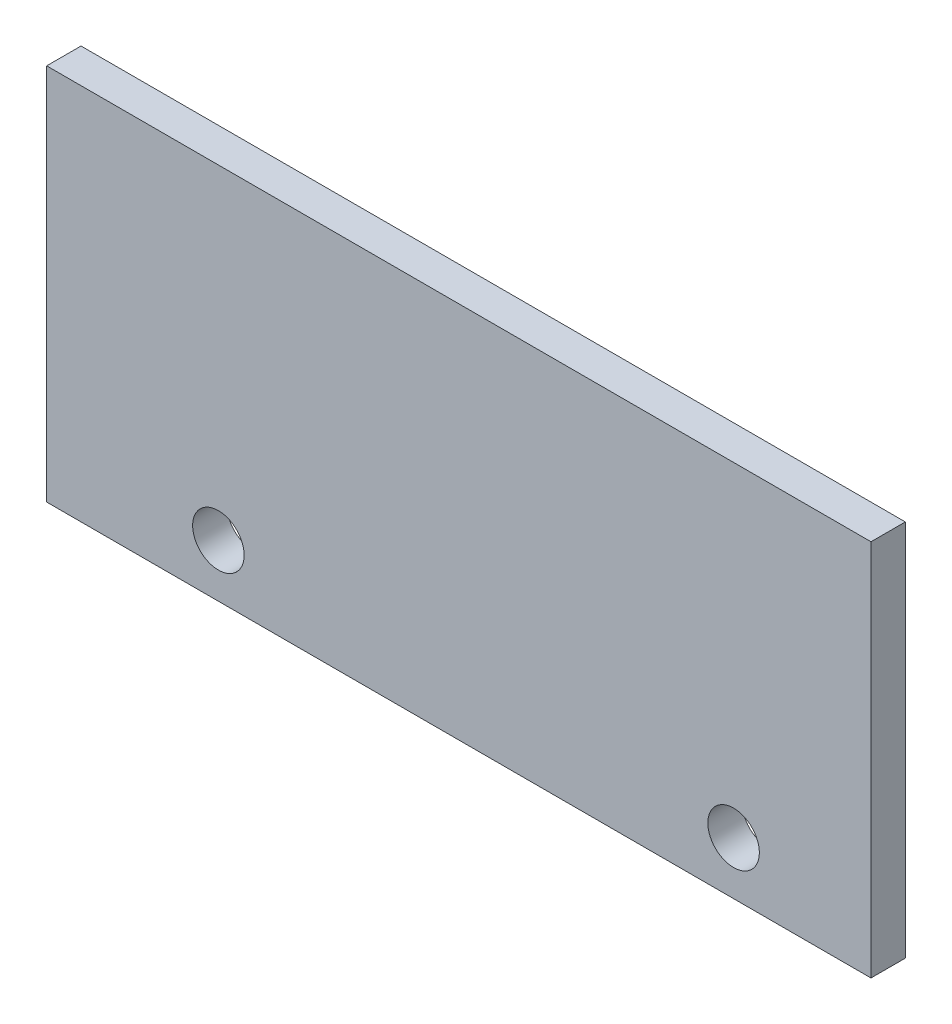
ISO-10303-21;
HEADER;
FILE_DESCRIPTION(('STEP AP214'),'2;1');
FILE_NAME('part.step','',(''),(''),'','','');
FILE_SCHEMA(('AUTOMOTIVE_DESIGN { 1 0 10303 214 1 1 1 1 }'));
ENDSEC;
DATA;
#1=APPLICATION_CONTEXT('core data for automotive mechanical design processes');
#2=APPLICATION_PROTOCOL_DEFINITION('international standard','automotive_design',2000,#1);
#3=PRODUCT_CONTEXT('',#1,'mechanical');
#4=PRODUCT('Part','Part','',(#3));
#5=PRODUCT_RELATED_PRODUCT_CATEGORY('part','',(#4));
#6=PRODUCT_DEFINITION_FORMATION('','',#4);
#7=PRODUCT_DEFINITION_CONTEXT('part definition',#1,'design');
#8=PRODUCT_DEFINITION('design','',#6,#7);
#9=PRODUCT_DEFINITION_SHAPE('','',#8);
#10=(LENGTH_UNIT() NAMED_UNIT(*) SI_UNIT(.MILLI.,.METRE.));
#11=(NAMED_UNIT(*) PLANE_ANGLE_UNIT() SI_UNIT($,.RADIAN.));
#12=(NAMED_UNIT(*) SI_UNIT($,.STERADIAN.) SOLID_ANGLE_UNIT());
#13=UNCERTAINTY_MEASURE_WITH_UNIT(LENGTH_MEASURE(1.E-05),#10,'distance_accuracy_value','');
#14=(GEOMETRIC_REPRESENTATION_CONTEXT(3) GLOBAL_UNCERTAINTY_ASSIGNED_CONTEXT((#13)) GLOBAL_UNIT_ASSIGNED_CONTEXT((#10,
#11,#12)) REPRESENTATION_CONTEXT('',''));
#15=CARTESIAN_POINT('',(0.,0.,0.));
#16=DIRECTION('',(0.,0.,1.));
#17=DIRECTION('',(1.,0.,0.));
#18=AXIS2_PLACEMENT_3D('',#15,#16,#17);
#19=CARTESIAN_POINT('',(673.1,330.2,6.35));
#20=DIRECTION('',(1.,0.,0.));
#21=DIRECTION('',(0.,1.,0.));
#22=AXIS2_PLACEMENT_3D('',#19,#20,#21);
#23=PLANE('',#22);
#24=DIRECTION('',(0.,-1.,0.));
#25=VECTOR('',#24,1.);
#26=CARTESIAN_POINT('',(673.1,330.2,0.));
#27=LINE('',#26,#25);
#28=CARTESIAN_POINT('',(673.1,330.2,0.));
#29=VERTEX_POINT('',#28);
#30=CARTESIAN_POINT('',(673.1,260.35,0.));
#31=VERTEX_POINT('',#30);
#32=EDGE_CURVE('E113',#29,#31,#27,.T.);
#33=ORIENTED_EDGE('',*,*,#32,.T.);
#34=DIRECTION('',(0.,0.,-1.));
#35=VECTOR('',#34,1.);
#36=CARTESIAN_POINT('',(673.1,260.35,6.35));
#37=LINE('',#36,#35);
#38=CARTESIAN_POINT('',(673.1,260.35,6.35));
#39=VERTEX_POINT('',#38);
#40=EDGE_CURVE('E11',#39,#31,#37,.T.);
#41=ORIENTED_EDGE('',*,*,#40,.F.);
#42=DIRECTION('',(0.,-1.,0.));
#43=VECTOR('',#42,1.);
#44=CARTESIAN_POINT('',(673.1,330.2,6.35));
#45=LINE('',#44,#43);
#46=CARTESIAN_POINT('',(673.1,330.2,6.35));
#47=VERTEX_POINT('',#46);
#48=EDGE_CURVE('E96',#47,#39,#45,.T.);
#49=ORIENTED_EDGE('',*,*,#48,.F.);
#50=DIRECTION('',(0.,0.,-1.));
#51=VECTOR('',#50,1.);
#52=CARTESIAN_POINT('',(673.1,330.2,6.35));
#53=LINE('',#52,#51);
#54=EDGE_CURVE('E109',#47,#29,#53,.T.);
#55=ORIENTED_EDGE('',*,*,#54,.T.);
#56=EDGE_LOOP('',(#33,#41,#49,#55));
#57=FACE_BOUND('',#56,.T.);
#58=ADVANCED_FACE('F38',(#57),#23,.F.);
#59=CARTESIAN_POINT('',(673.1,260.35,6.35));
#60=DIRECTION('',(0.,1.,0.));
#61=DIRECTION('',(0.,0.,1.));
#62=AXIS2_PLACEMENT_3D('',#59,#60,#61);
#63=PLANE('',#62);
#64=DIRECTION('',(1.,0.,0.));
#65=VECTOR('',#64,1.);
#66=CARTESIAN_POINT('',(673.1,260.35,0.));
#67=LINE('',#66,#65);
#68=CARTESIAN_POINT('',(825.5,260.35,0.));
#69=VERTEX_POINT('',#68);
#70=EDGE_CURVE('E101',#31,#69,#67,.T.);
#71=ORIENTED_EDGE('',*,*,#70,.T.);
#72=DIRECTION('',(0.,0.,-1.));
#73=VECTOR('',#72,1.);
#74=CARTESIAN_POINT('',(825.5,260.35,6.35));
#75=LINE('',#74,#73);
#76=CARTESIAN_POINT('',(825.5,260.35,6.35));
#77=VERTEX_POINT('',#76);
#78=EDGE_CURVE('E47',#77,#69,#75,.T.);
#79=ORIENTED_EDGE('',*,*,#78,.F.);
#80=DIRECTION('',(1.,0.,0.));
#81=VECTOR('',#80,1.);
#82=CARTESIAN_POINT('',(673.1,260.35,6.35));
#83=LINE('',#82,#81);
#84=EDGE_CURVE('E91',#39,#77,#83,.T.);
#85=ORIENTED_EDGE('',*,*,#84,.F.);
#86=ORIENTED_EDGE('',*,*,#40,.T.);
#87=EDGE_LOOP('',(#71,#79,#85,#86));
#88=FACE_BOUND('',#87,.T.);
#89=ADVANCED_FACE('F100',(#88),#63,.F.);
#90=CARTESIAN_POINT('',(825.5,330.2,6.35));
#91=DIRECTION('',(-1.,0.,0.));
#92=DIRECTION('',(0.,0.,1.));
#93=AXIS2_PLACEMENT_3D('',#90,#91,#92);
#94=PLANE('',#93);
#95=DIRECTION('',(0.,1.,0.));
#96=VECTOR('',#95,1.);
#97=CARTESIAN_POINT('',(825.5,330.2,0.));
#98=LINE('',#97,#96);
#99=CARTESIAN_POINT('',(825.5,330.2,0.));
#100=VERTEX_POINT('',#99);
#101=EDGE_CURVE('E77',#69,#100,#98,.T.);
#102=ORIENTED_EDGE('',*,*,#101,.T.);
#103=DIRECTION('',(0.,0.,-1.));
#104=VECTOR('',#103,1.);
#105=CARTESIAN_POINT('',(825.5,330.2,6.35));
#106=LINE('',#105,#104);
#107=CARTESIAN_POINT('',(825.5,330.2,6.35));
#108=VERTEX_POINT('',#107);
#109=EDGE_CURVE('E102',#108,#100,#106,.T.);
#110=ORIENTED_EDGE('',*,*,#109,.F.);
#111=DIRECTION('',(0.,1.,0.));
#112=VECTOR('',#111,1.);
#113=CARTESIAN_POINT('',(825.5,330.2,6.35));
#114=LINE('',#113,#112);
#115=EDGE_CURVE('E94',#77,#108,#114,.T.);
#116=ORIENTED_EDGE('',*,*,#115,.F.);
#117=ORIENTED_EDGE('',*,*,#78,.T.);
#118=EDGE_LOOP('',(#102,#110,#116,#117));
#119=FACE_BOUND('',#118,.T.);
#120=ADVANCED_FACE('F103',(#119),#94,.F.);
#121=CARTESIAN_POINT('',(673.1,330.2,6.35));
#122=DIRECTION('',(0.,-1.,0.));
#123=DIRECTION('',(1.,0.,0.));
#124=AXIS2_PLACEMENT_3D('',#121,#122,#123);
#125=PLANE('',#124);
#126=DIRECTION('',(-1.,0.,0.));
#127=VECTOR('',#126,1.);
#128=CARTESIAN_POINT('',(673.1,330.2,0.));
#129=LINE('',#128,#127);
#130=EDGE_CURVE('E84',#100,#29,#129,.T.);
#131=ORIENTED_EDGE('',*,*,#130,.T.);
#132=ORIENTED_EDGE('',*,*,#54,.F.);
#133=DIRECTION('',(-1.,0.,0.));
#134=VECTOR('',#133,1.);
#135=CARTESIAN_POINT('',(673.1,330.2,6.35));
#136=LINE('',#135,#134);
#137=EDGE_CURVE('E57',#108,#47,#136,.T.);
#138=ORIENTED_EDGE('',*,*,#137,.F.);
#139=ORIENTED_EDGE('',*,*,#109,.T.);
#140=EDGE_LOOP('',(#131,#132,#138,#139));
#141=FACE_BOUND('',#140,.T.);
#142=ADVANCED_FACE('F125',(#141),#125,.F.);
#143=CARTESIAN_POINT('',(673.1,260.35,6.35));
#144=DIRECTION('',(0.,0.,1.));
#145=DIRECTION('',(1.,0.,0.));
#146=AXIS2_PLACEMENT_3D('',#143,#144,#145);
#147=PLANE('',#146);
#148=CARTESIAN_POINT('',(704.85,270.09725,6.35));
#149=DIRECTION('',(0.,0.,1.));
#150=DIRECTION('',(1.,0.,0.));
#151=AXIS2_PLACEMENT_3D('',#148,#149,#150);
#152=CIRCLE('',#151,4.76250000000001);
#153=CARTESIAN_POINT('',(709.6125,270.09725,6.35));
#154=VERTEX_POINT('',#153);
#155=EDGE_CURVE('E140',#154,#154,#152,.T.);
#156=ORIENTED_EDGE('',*,*,#155,.F.);
#157=EDGE_LOOP('',(#156));
#158=FACE_BOUND('',#157,.T.);
#159=CARTESIAN_POINT('',(800.1,270.09725,6.35));
#160=DIRECTION('',(0.,0.,1.));
#161=DIRECTION('',(1.,0.,0.));
#162=AXIS2_PLACEMENT_3D('',#159,#160,#161);
#163=CIRCLE('',#162,4.7624999999999);
#164=CARTESIAN_POINT('',(804.8625,270.09725,6.35));
#165=VERTEX_POINT('',#164);
#166=EDGE_CURVE('E132',#165,#165,#163,.T.);
#167=ORIENTED_EDGE('',*,*,#166,.F.);
#168=EDGE_LOOP('',(#167));
#169=FACE_BOUND('',#168,.T.);
#170=ORIENTED_EDGE('',*,*,#48,.T.);
#171=ORIENTED_EDGE('',*,*,#84,.T.);
#172=ORIENTED_EDGE('',*,*,#115,.T.);
#173=ORIENTED_EDGE('',*,*,#137,.T.);
#174=EDGE_LOOP('',(#170,#171,#172,#173));
#175=FACE_BOUND('',#174,.T.);
#176=ADVANCED_FACE('F92',(#158,#169,#175),#147,.T.);
#177=CARTESIAN_POINT('',(673.1,260.35,0.));
#178=DIRECTION('',(0.,0.,1.));
#179=DIRECTION('',(1.,0.,0.));
#180=AXIS2_PLACEMENT_3D('',#177,#178,#179);
#181=PLANE('',#180);
#182=CARTESIAN_POINT('',(704.85,270.09725,0.));
#183=DIRECTION('',(0.,0.,1.));
#184=DIRECTION('',(1.,0.,0.));
#185=AXIS2_PLACEMENT_3D('',#182,#183,#184);
#186=CIRCLE('',#185,4.76250000000001);
#187=CARTESIAN_POINT('',(709.6125,270.09725,0.));
#188=VERTEX_POINT('',#187);
#189=EDGE_CURVE('E136',#188,#188,#186,.T.);
#190=ORIENTED_EDGE('',*,*,#189,.T.);
#191=EDGE_LOOP('',(#190));
#192=FACE_BOUND('',#191,.T.);
#193=CARTESIAN_POINT('',(800.1,270.09725,0.));
#194=DIRECTION('',(0.,0.,1.));
#195=DIRECTION('',(1.,0.,0.));
#196=AXIS2_PLACEMENT_3D('',#193,#194,#195);
#197=CIRCLE('',#196,4.7624999999999);
#198=CARTESIAN_POINT('',(804.8625,270.09725,0.));
#199=VERTEX_POINT('',#198);
#200=EDGE_CURVE('E117',#199,#199,#197,.T.);
#201=ORIENTED_EDGE('',*,*,#200,.T.);
#202=EDGE_LOOP('',(#201));
#203=FACE_BOUND('',#202,.T.);
#204=ORIENTED_EDGE('',*,*,#32,.F.);
#205=ORIENTED_EDGE('',*,*,#130,.F.);
#206=ORIENTED_EDGE('',*,*,#101,.F.);
#207=ORIENTED_EDGE('',*,*,#70,.F.);
#208=EDGE_LOOP('',(#204,#205,#206,#207));
#209=FACE_BOUND('',#208,.T.);
#210=ADVANCED_FACE('F128',(#192,#203,#209),#181,.F.);
#211=CARTESIAN_POINT('',(800.1,270.09725,0.));
#212=DIRECTION('',(0.,0.,1.));
#213=DIRECTION('',(1.,0.,0.));
#214=AXIS2_PLACEMENT_3D('',#211,#212,#213);
#215=CYLINDRICAL_SURFACE('',#214,4.7624999999999);
#216=ORIENTED_EDGE('',*,*,#200,.F.);
#217=EDGE_LOOP('',(#216));
#218=FACE_BOUND('',#217,.T.);
#219=ORIENTED_EDGE('',*,*,#166,.T.);
#220=EDGE_LOOP('',(#219));
#221=FACE_BOUND('',#220,.T.);
#222=ADVANCED_FACE('F153',(#218,#221),#215,.F.);
#223=CARTESIAN_POINT('',(704.85,270.09725,0.));
#224=DIRECTION('',(0.,0.,1.));
#225=DIRECTION('',(1.,0.,0.));
#226=AXIS2_PLACEMENT_3D('',#223,#224,#225);
#227=CYLINDRICAL_SURFACE('',#226,4.76250000000001);
#228=ORIENTED_EDGE('',*,*,#189,.F.);
#229=EDGE_LOOP('',(#228));
#230=FACE_BOUND('',#229,.T.);
#231=ORIENTED_EDGE('',*,*,#155,.T.);
#232=EDGE_LOOP('',(#231));
#233=FACE_BOUND('',#232,.T.);
#234=ADVANCED_FACE('F150',(#230,#233),#227,.F.);
#235=CLOSED_SHELL('',(#58,#89,#120,#142,#176,#210,#222,#234));
#236=MANIFOLD_SOLID_BREP('B2',#235);
#237=ADVANCED_BREP_SHAPE_REPRESENTATION('',(#18,#236),#14);
#238=SHAPE_DEFINITION_REPRESENTATION(#9,#237);
ENDSEC;
END-ISO-10303-21;
